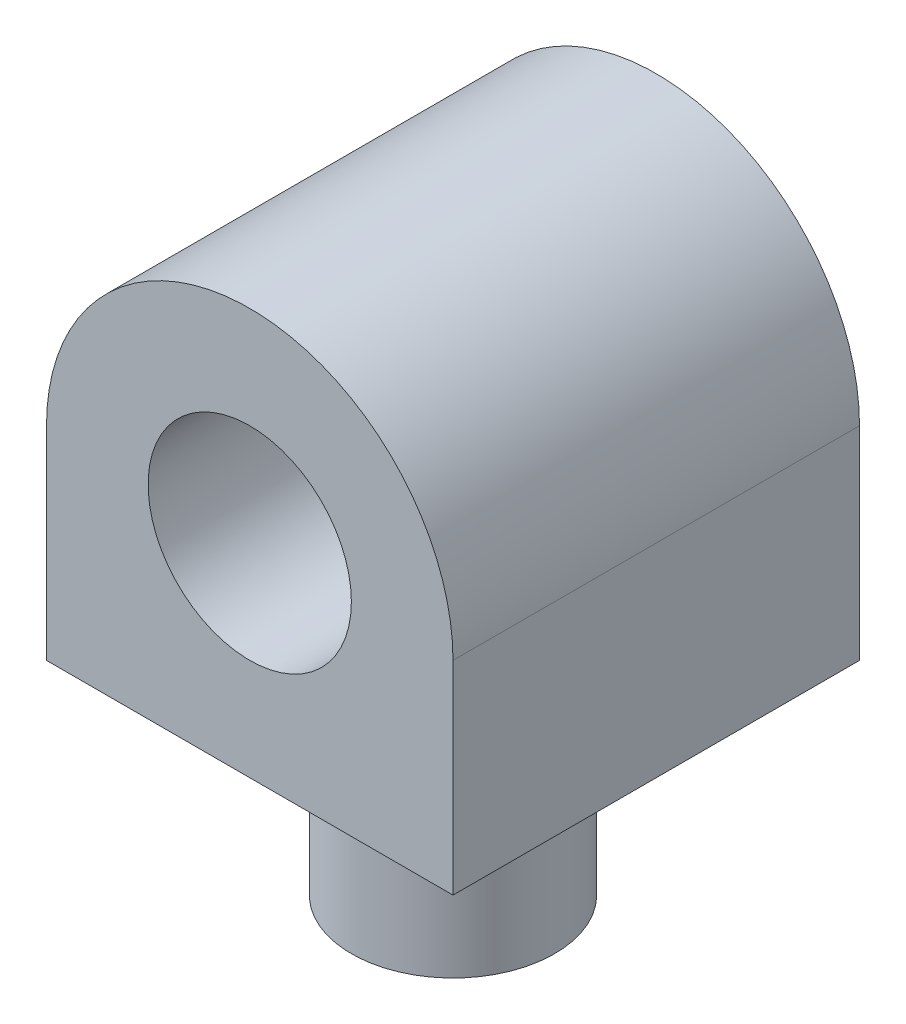
ISO-10303-21;
HEADER;
FILE_DESCRIPTION(('STEP AP214'),'2;1');
FILE_NAME('part.step','',(''),(''),'','','');
FILE_SCHEMA(('AUTOMOTIVE_DESIGN { 1 0 10303 214 1 1 1 1 }'));
ENDSEC;
DATA;
#1=APPLICATION_CONTEXT('core data for automotive mechanical design processes');
#2=APPLICATION_PROTOCOL_DEFINITION('international standard','automotive_design',2000,#1);
#3=PRODUCT_CONTEXT('',#1,'mechanical');
#4=PRODUCT('Part','Part','',(#3));
#5=PRODUCT_RELATED_PRODUCT_CATEGORY('part','',(#4));
#6=PRODUCT_DEFINITION_FORMATION('','',#4);
#7=PRODUCT_DEFINITION_CONTEXT('part definition',#1,'design');
#8=PRODUCT_DEFINITION('design','',#6,#7);
#9=PRODUCT_DEFINITION_SHAPE('','',#8);
#10=(LENGTH_UNIT() NAMED_UNIT(*) SI_UNIT(.MILLI.,.METRE.));
#11=(NAMED_UNIT(*) PLANE_ANGLE_UNIT() SI_UNIT($,.RADIAN.));
#12=(NAMED_UNIT(*) SI_UNIT($,.STERADIAN.) SOLID_ANGLE_UNIT());
#13=UNCERTAINTY_MEASURE_WITH_UNIT(LENGTH_MEASURE(1.E-05),#10,'distance_accuracy_value','');
#14=(GEOMETRIC_REPRESENTATION_CONTEXT(3) GLOBAL_UNCERTAINTY_ASSIGNED_CONTEXT((#13)) GLOBAL_UNIT_ASSIGNED_CONTEXT((#10,
#11,#12)) REPRESENTATION_CONTEXT('',''));
#15=CARTESIAN_POINT('',(0.,0.,0.));
#16=DIRECTION('',(0.,0.,1.));
#17=DIRECTION('',(1.,0.,0.));
#18=AXIS2_PLACEMENT_3D('',#15,#16,#17);
#19=CARTESIAN_POINT('',(0.,0.,30.));
#20=DIRECTION('',(0.,0.,-1.));
#21=DIRECTION('',(-1.,0.,0.));
#22=AXIS2_PLACEMENT_3D('',#19,#20,#21);
#23=PLANE('',#22);
#24=CARTESIAN_POINT('',(0.,0.,30.));
#25=DIRECTION('',(0.,0.,1.));
#26=DIRECTION('',(-1.,0.,0.));
#27=AXIS2_PLACEMENT_3D('',#24,#25,#26);
#28=CIRCLE('',#27,30.);
#29=CARTESIAN_POINT('',(30.,0.,30.));
#30=VERTEX_POINT('',#29);
#31=CARTESIAN_POINT('',(-30.,0.,30.));
#32=VERTEX_POINT('',#31);
#33=EDGE_CURVE('E88',#30,#32,#28,.T.);
#34=ORIENTED_EDGE('',*,*,#33,.T.);
#35=DIRECTION('',(0.,-1.,0.));
#36=VECTOR('',#35,1.);
#37=CARTESIAN_POINT('',(-30.,0.,30.));
#38=LINE('',#37,#36);
#39=CARTESIAN_POINT('',(-30.,-30.,30.));
#40=VERTEX_POINT('',#39);
#41=EDGE_CURVE('E83',#32,#40,#38,.T.);
#42=ORIENTED_EDGE('',*,*,#41,.T.);
#43=DIRECTION('',(1.,0.,0.));
#44=VECTOR('',#43,1.);
#45=CARTESIAN_POINT('',(-30.,-30.,30.));
#46=LINE('',#45,#44);
#47=CARTESIAN_POINT('',(30.,-30.,30.));
#48=VERTEX_POINT('',#47);
#49=EDGE_CURVE('E86',#40,#48,#46,.T.);
#50=ORIENTED_EDGE('',*,*,#49,.T.);
#51=DIRECTION('',(0.,1.,0.));
#52=VECTOR('',#51,1.);
#53=CARTESIAN_POINT('',(30.,0.,30.));
#54=LINE('',#53,#52);
#55=EDGE_CURVE('E52',#48,#30,#54,.T.);
#56=ORIENTED_EDGE('',*,*,#55,.T.);
#57=EDGE_LOOP('',(#34,#42,#50,#56));
#58=FACE_BOUND('',#57,.T.);
#59=CARTESIAN_POINT('',(0.,0.,30.));
#60=DIRECTION('',(0.,0.,1.));
#61=DIRECTION('',(1.,0.,0.));
#62=AXIS2_PLACEMENT_3D('',#59,#60,#61);
#63=CIRCLE('',#62,15.);
#64=CARTESIAN_POINT('',(15.,0.,30.));
#65=VERTEX_POINT('',#64);
#66=EDGE_CURVE('E104',#65,#65,#63,.T.);
#67=ORIENTED_EDGE('',*,*,#66,.F.);
#68=EDGE_LOOP('',(#67));
#69=FACE_BOUND('',#68,.T.);
#70=ADVANCED_FACE('F34',(#58,#69),#23,.F.);
#71=CARTESIAN_POINT('',(0.,0.,-30.));
#72=DIRECTION('',(0.,0.,-1.));
#73=DIRECTION('',(-1.,0.,0.));
#74=AXIS2_PLACEMENT_3D('',#71,#72,#73);
#75=PLANE('',#74);
#76=CARTESIAN_POINT('',(0.,0.,-30.));
#77=DIRECTION('',(0.,0.,1.));
#78=DIRECTION('',(-1.,0.,0.));
#79=AXIS2_PLACEMENT_3D('',#76,#77,#78);
#80=CIRCLE('',#79,30.);
#81=CARTESIAN_POINT('',(30.,0.,-30.));
#82=VERTEX_POINT('',#81);
#83=CARTESIAN_POINT('',(-30.,0.,-30.));
#84=VERTEX_POINT('',#83);
#85=EDGE_CURVE('E101',#82,#84,#80,.T.);
#86=ORIENTED_EDGE('',*,*,#85,.F.);
#87=DIRECTION('',(0.,1.,0.));
#88=VECTOR('',#87,1.);
#89=CARTESIAN_POINT('',(30.,0.,-30.));
#90=LINE('',#89,#88);
#91=CARTESIAN_POINT('',(30.,-30.,-30.));
#92=VERTEX_POINT('',#91);
#93=EDGE_CURVE('E75',#92,#82,#90,.T.);
#94=ORIENTED_EDGE('',*,*,#93,.F.);
#95=DIRECTION('',(1.,0.,0.));
#96=VECTOR('',#95,1.);
#97=CARTESIAN_POINT('',(-30.,-30.,-30.));
#98=LINE('',#97,#96);
#99=CARTESIAN_POINT('',(-30.,-30.,-30.));
#100=VERTEX_POINT('',#99);
#101=EDGE_CURVE('E69',#100,#92,#98,.T.);
#102=ORIENTED_EDGE('',*,*,#101,.F.);
#103=DIRECTION('',(0.,-1.,0.));
#104=VECTOR('',#103,1.);
#105=CARTESIAN_POINT('',(-30.,0.,-30.));
#106=LINE('',#105,#104);
#107=EDGE_CURVE('E93',#84,#100,#106,.T.);
#108=ORIENTED_EDGE('',*,*,#107,.F.);
#109=EDGE_LOOP('',(#86,#94,#102,#108));
#110=FACE_BOUND('',#109,.T.);
#111=CARTESIAN_POINT('',(0.,0.,-30.));
#112=DIRECTION('',(0.,0.,1.));
#113=DIRECTION('',(1.,0.,0.));
#114=AXIS2_PLACEMENT_3D('',#111,#112,#113);
#115=CIRCLE('',#114,15.);
#116=CARTESIAN_POINT('',(15.,0.,-30.));
#117=VERTEX_POINT('',#116);
#118=EDGE_CURVE('E116',#117,#117,#115,.T.);
#119=ORIENTED_EDGE('',*,*,#118,.T.);
#120=EDGE_LOOP('',(#119));
#121=FACE_BOUND('',#120,.T.);
#122=ADVANCED_FACE('F112',(#110,#121),#75,.T.);
#123=CARTESIAN_POINT('',(0.,0.,30.));
#124=DIRECTION('',(0.,0.,-1.));
#125=DIRECTION('',(-1.,0.,0.));
#126=AXIS2_PLACEMENT_3D('',#123,#124,#125);
#127=CYLINDRICAL_SURFACE('',#126,30.);
#128=ORIENTED_EDGE('',*,*,#85,.T.);
#129=DIRECTION('',(0.,0.,-1.));
#130=VECTOR('',#129,1.);
#131=CARTESIAN_POINT('',(-30.,0.,30.));
#132=LINE('',#131,#130);
#133=EDGE_CURVE('E38',#32,#84,#132,.T.);
#134=ORIENTED_EDGE('',*,*,#133,.F.);
#135=ORIENTED_EDGE('',*,*,#33,.F.);
#136=DIRECTION('',(0.,0.,-1.));
#137=VECTOR('',#136,1.);
#138=CARTESIAN_POINT('',(30.,0.,30.));
#139=LINE('',#138,#137);
#140=EDGE_CURVE('E97',#30,#82,#139,.T.);
#141=ORIENTED_EDGE('',*,*,#140,.T.);
#142=EDGE_LOOP('',(#128,#134,#135,#141));
#143=FACE_BOUND('',#142,.T.);
#144=ADVANCED_FACE('F36',(#143),#127,.T.);
#145=CARTESIAN_POINT('',(-30.,0.,30.));
#146=DIRECTION('',(1.,0.,0.));
#147=DIRECTION('',(0.,1.,0.));
#148=AXIS2_PLACEMENT_3D('',#145,#146,#147);
#149=PLANE('',#148);
#150=ORIENTED_EDGE('',*,*,#107,.T.);
#151=DIRECTION('',(0.,0.,-1.));
#152=VECTOR('',#151,1.);
#153=CARTESIAN_POINT('',(-30.,-30.,30.));
#154=LINE('',#153,#152);
#155=EDGE_CURVE('E91',#40,#100,#154,.T.);
#156=ORIENTED_EDGE('',*,*,#155,.F.);
#157=ORIENTED_EDGE('',*,*,#41,.F.);
#158=ORIENTED_EDGE('',*,*,#133,.T.);
#159=EDGE_LOOP('',(#150,#156,#157,#158));
#160=FACE_BOUND('',#159,.T.);
#161=ADVANCED_FACE('F92',(#160),#149,.F.);
#162=CARTESIAN_POINT('',(-30.,-30.,30.));
#163=DIRECTION('',(0.,1.,0.));
#164=DIRECTION('',(0.,0.,1.));
#165=AXIS2_PLACEMENT_3D('',#162,#163,#164);
#166=PLANE('',#165);
#167=CARTESIAN_POINT('',(0.,-30.,0.));
#168=DIRECTION('',(0.,-1.,0.));
#169=DIRECTION('',(0.,0.,-1.));
#170=AXIS2_PLACEMENT_3D('',#167,#168,#169);
#171=CIRCLE('',#170,15.);
#172=CARTESIAN_POINT('',(0.,-30.,-15.));
#173=VERTEX_POINT('',#172);
#174=EDGE_CURVE('E11',#173,#173,#171,.T.);
#175=ORIENTED_EDGE('',*,*,#174,.F.);
#176=EDGE_LOOP('',(#175));
#177=FACE_BOUND('',#176,.T.);
#178=ORIENTED_EDGE('',*,*,#101,.T.);
#179=DIRECTION('',(0.,0.,-1.));
#180=VECTOR('',#179,1.);
#181=CARTESIAN_POINT('',(30.,-30.,30.));
#182=LINE('',#181,#180);
#183=EDGE_CURVE('E94',#48,#92,#182,.T.);
#184=ORIENTED_EDGE('',*,*,#183,.F.);
#185=ORIENTED_EDGE('',*,*,#49,.F.);
#186=ORIENTED_EDGE('',*,*,#155,.T.);
#187=EDGE_LOOP('',(#178,#184,#185,#186));
#188=FACE_BOUND('',#187,.T.);
#189=ADVANCED_FACE('F95',(#177,#188),#166,.F.);
#190=CARTESIAN_POINT('',(30.,0.,30.));
#191=DIRECTION('',(-1.,0.,0.));
#192=DIRECTION('',(0.,-1.,0.));
#193=AXIS2_PLACEMENT_3D('',#190,#191,#192);
#194=PLANE('',#193);
#195=ORIENTED_EDGE('',*,*,#93,.T.);
#196=ORIENTED_EDGE('',*,*,#140,.F.);
#197=ORIENTED_EDGE('',*,*,#55,.F.);
#198=ORIENTED_EDGE('',*,*,#183,.T.);
#199=EDGE_LOOP('',(#195,#196,#197,#198));
#200=FACE_BOUND('',#199,.T.);
#201=ADVANCED_FACE('F109',(#200),#194,.F.);
#202=CARTESIAN_POINT('',(0.,0.,30.));
#203=DIRECTION('',(0.,0.,-1.));
#204=DIRECTION('',(-1.,0.,0.));
#205=AXIS2_PLACEMENT_3D('',#202,#203,#204);
#206=CYLINDRICAL_SURFACE('',#205,15.);
#207=ORIENTED_EDGE('',*,*,#66,.T.);
#208=EDGE_LOOP('',(#207));
#209=FACE_BOUND('',#208,.T.);
#210=ORIENTED_EDGE('',*,*,#118,.F.);
#211=EDGE_LOOP('',(#210));
#212=FACE_BOUND('',#211,.T.);
#213=ADVANCED_FACE('F130',(#209,#212),#206,.F.);
#214=CARTESIAN_POINT('',(0.,-60.,0.));
#215=DIRECTION('',(0.,1.,0.));
#216=DIRECTION('',(0.,0.,1.));
#217=AXIS2_PLACEMENT_3D('',#214,#215,#216);
#218=CYLINDRICAL_SURFACE('',#217,15.);
#219=CARTESIAN_POINT('',(0.,-60.,0.));
#220=DIRECTION('',(0.,-1.,0.));
#221=DIRECTION('',(0.,0.,-1.));
#222=AXIS2_PLACEMENT_3D('',#219,#220,#221);
#223=CIRCLE('',#222,15.);
#224=CARTESIAN_POINT('',(0.,-60.,-15.));
#225=VERTEX_POINT('',#224);
#226=EDGE_CURVE('E119',#225,#225,#223,.T.);
#227=ORIENTED_EDGE('',*,*,#226,.F.);
#228=EDGE_LOOP('',(#227));
#229=FACE_BOUND('',#228,.T.);
#230=ORIENTED_EDGE('',*,*,#174,.T.);
#231=EDGE_LOOP('',(#230));
#232=FACE_BOUND('',#231,.T.);
#233=ADVANCED_FACE('F127',(#229,#232),#218,.T.);
#234=CARTESIAN_POINT('',(0.,-60.,0.));
#235=DIRECTION('',(0.,-1.,0.));
#236=DIRECTION('',(0.,0.,-1.));
#237=AXIS2_PLACEMENT_3D('',#234,#235,#236);
#238=PLANE('',#237);
#239=ORIENTED_EDGE('',*,*,#226,.T.);
#240=EDGE_LOOP('',(#239));
#241=FACE_BOUND('',#240,.T.);
#242=ADVANCED_FACE('F125',(#241),#238,.T.);
#243=CLOSED_SHELL('',(#70,#122,#144,#161,#189,#201,#213,#233,#242));
#244=MANIFOLD_SOLID_BREP('B2',#243);
#245=ADVANCED_BREP_SHAPE_REPRESENTATION('',(#18,#244),#14);
#246=SHAPE_DEFINITION_REPRESENTATION(#9,#245);
ENDSEC;
END-ISO-10303-21;
